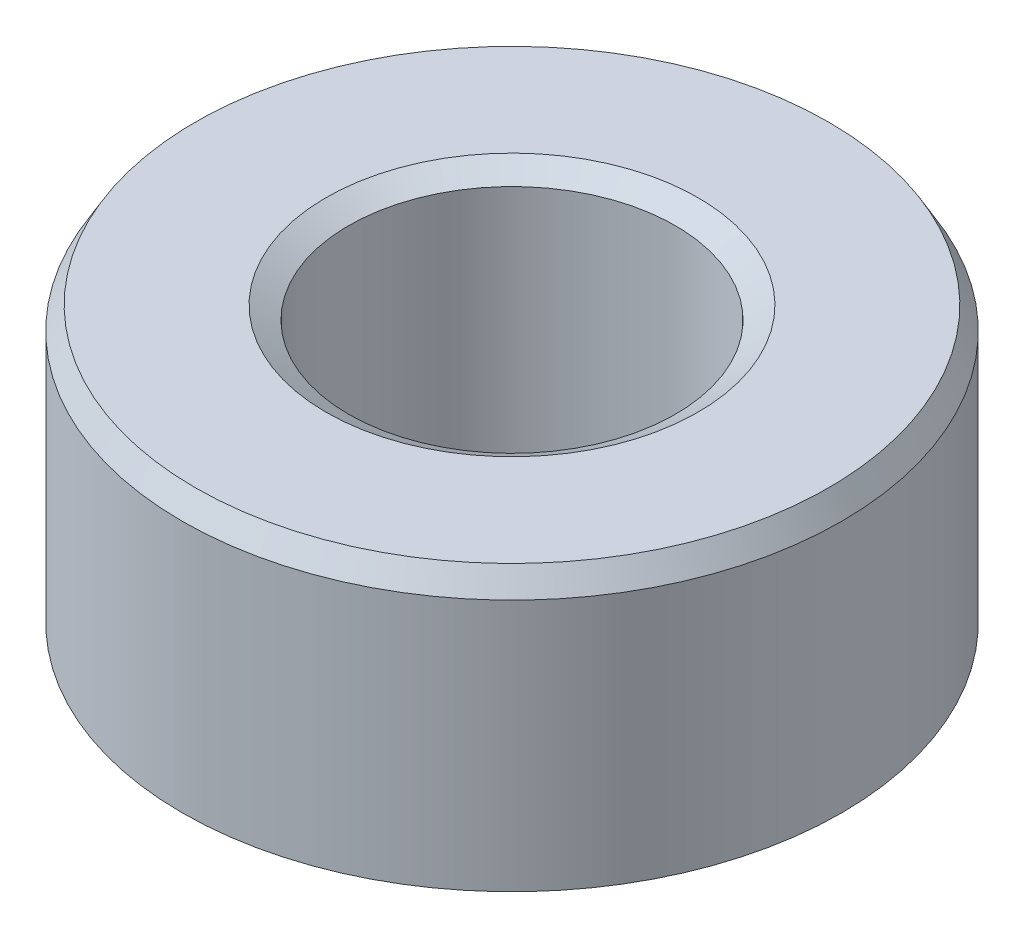
ISO-10303-21;
HEADER;
FILE_DESCRIPTION(('STEP AP214'),'2;1');
FILE_NAME('part.step','',(''),(''),'','','');
FILE_SCHEMA(('AUTOMOTIVE_DESIGN { 1 0 10303 214 1 1 1 1 }'));
ENDSEC;
DATA;
#1=APPLICATION_CONTEXT('core data for automotive mechanical design processes');
#2=APPLICATION_PROTOCOL_DEFINITION('international standard','automotive_design',2000,#1);
#3=PRODUCT_CONTEXT('',#1,'mechanical');
#4=PRODUCT('Part','Part','',(#3));
#5=PRODUCT_RELATED_PRODUCT_CATEGORY('part','',(#4));
#6=PRODUCT_DEFINITION_FORMATION('','',#4);
#7=PRODUCT_DEFINITION_CONTEXT('part definition',#1,'design');
#8=PRODUCT_DEFINITION('design','',#6,#7);
#9=PRODUCT_DEFINITION_SHAPE('','',#8);
#10=(LENGTH_UNIT() NAMED_UNIT(*) SI_UNIT(.MILLI.,.METRE.));
#11=(NAMED_UNIT(*) PLANE_ANGLE_UNIT() SI_UNIT($,.RADIAN.));
#12=(NAMED_UNIT(*) SI_UNIT($,.STERADIAN.) SOLID_ANGLE_UNIT());
#13=UNCERTAINTY_MEASURE_WITH_UNIT(LENGTH_MEASURE(1.E-05),#10,'distance_accuracy_value','');
#14=(GEOMETRIC_REPRESENTATION_CONTEXT(3) GLOBAL_UNCERTAINTY_ASSIGNED_CONTEXT((#13)) GLOBAL_UNIT_ASSIGNED_CONTEXT((#10,
#11,#12)) REPRESENTATION_CONTEXT('',''));
#15=CARTESIAN_POINT('',(0.,0.,0.));
#16=DIRECTION('',(0.,0.,1.));
#17=DIRECTION('',(1.,0.,0.));
#18=AXIS2_PLACEMENT_3D('',#15,#16,#17);
#19=CARTESIAN_POINT('',(0.,48.0601780285572,0.));
#20=DIRECTION('',(0.,-1.,0.));
#21=DIRECTION('',(0.,0.,-1.));
#22=AXIS2_PLACEMENT_3D('',#19,#20,#21);
#23=CYLINDRICAL_SURFACE('',#22,55.);
#24=CARTESIAN_POINT('',(0.,2.17141294679618,0.));
#25=DIRECTION('',(0.,1.,0.));
#26=DIRECTION('',(0.,0.,1.));
#27=AXIS2_PLACEMENT_3D('',#24,#25,#26);
#28=CIRCLE('',#27,55.);
#29=CARTESIAN_POINT('',(0.,2.17141294679618,55.));
#30=VERTEX_POINT('',#29);
#31=EDGE_CURVE('E10',#30,#30,#28,.T.);
#32=ORIENTED_EDGE('',*,*,#31,.T.);
#33=EDGE_LOOP('',(#32));
#34=FACE_BOUND('',#33,.T.);
#35=CARTESIAN_POINT('',(0.,44.2991804804934,0.));
#36=DIRECTION('',(0.,1.,0.));
#37=DIRECTION('',(0.,0.,1.));
#38=AXIS2_PLACEMENT_3D('',#35,#36,#37);
#39=CIRCLE('',#38,55.);
#40=CARTESIAN_POINT('',(0.,44.2991804804934,-55.));
#41=VERTEX_POINT('',#40);
#42=EDGE_CURVE('E50',#41,#41,#39,.F.);
#43=ORIENTED_EDGE('',*,*,#42,.T.);
#44=EDGE_LOOP('',(#43));
#45=FACE_BOUND('',#44,.T.);
#46=ADVANCED_FACE('F39',(#34,#45),#23,.T.);
#47=CARTESIAN_POINT('',(0.,48.0601780285572,0.));
#48=DIRECTION('',(0.,1.,0.));
#49=DIRECTION('',(0.,0.,1.));
#50=AXIS2_PLACEMENT_3D('',#47,#48,#49);
#51=PLANE('',#50);
#52=CARTESIAN_POINT('',(0.,48.0601780285572,0.));
#53=DIRECTION('',(0.,1.,0.));
#54=DIRECTION('',(0.,0.,1.));
#55=AXIS2_PLACEMENT_3D('',#52,#53,#54);
#56=CIRCLE('',#55,31.0200479257337);
#57=CARTESIAN_POINT('',(0.,48.0601780285572,31.0200479257337));
#58=VERTEX_POINT('',#57);
#59=EDGE_CURVE('E58',#58,#58,#56,.F.);
#60=ORIENTED_EDGE('',*,*,#59,.T.);
#61=EDGE_LOOP('',(#60));
#62=FACE_BOUND('',#61,.T.);
#63=CARTESIAN_POINT('',(0.,48.0601780285572,0.));
#64=DIRECTION('',(0.,1.,0.));
#65=DIRECTION('',(0.,0.,1.));
#66=AXIS2_PLACEMENT_3D('',#63,#64,#65);
#67=CIRCLE('',#66,52.8285870532038);
#68=CARTESIAN_POINT('',(0.,48.0601780285572,-52.8285870532038));
#69=VERTEX_POINT('',#68);
#70=EDGE_CURVE('E61',#69,#69,#67,.T.);
#71=ORIENTED_EDGE('',*,*,#70,.T.);
#72=EDGE_LOOP('',(#71));
#73=FACE_BOUND('',#72,.T.);
#74=ADVANCED_FACE('F88',(#62,#73),#51,.T.);
#75=CARTESIAN_POINT('',(0.,0.,0.));
#76=DIRECTION('',(0.,1.,0.));
#77=DIRECTION('',(0.,0.,1.));
#78=AXIS2_PLACEMENT_3D('',#75,#76,#77);
#79=PLANE('',#78);
#80=CARTESIAN_POINT('',(0.,0.,0.));
#81=DIRECTION('',(0.,1.,0.));
#82=DIRECTION('',(0.,0.,1.));
#83=AXIS2_PLACEMENT_3D('',#80,#81,#82);
#84=CIRCLE('',#83,29.430463324466);
#85=CARTESIAN_POINT('',(0.,0.,29.430463324466));
#86=VERTEX_POINT('',#85);
#87=EDGE_CURVE('E51',#86,#86,#84,.T.);
#88=ORIENTED_EDGE('',*,*,#87,.T.);
#89=EDGE_LOOP('',(#88));
#90=FACE_BOUND('',#89,.T.);
#91=CARTESIAN_POINT('',(0.,0.,0.));
#92=DIRECTION('',(0.,1.,0.));
#93=DIRECTION('',(0.,0.,1.));
#94=AXIS2_PLACEMENT_3D('',#91,#92,#93);
#95=CIRCLE('',#94,51.2390024519361);
#96=CARTESIAN_POINT('',(0.,0.,51.2390024519361));
#97=VERTEX_POINT('',#96);
#98=EDGE_CURVE('E54',#97,#97,#95,.F.);
#99=ORIENTED_EDGE('',*,*,#98,.T.);
#100=EDGE_LOOP('',(#99));
#101=FACE_BOUND('',#100,.T.);
#102=ADVANCED_FACE('F83',(#90,#101),#79,.F.);
#103=CARTESIAN_POINT('',(0.,48.0601780285572,0.));
#104=DIRECTION('',(0.,-1.,0.));
#105=DIRECTION('',(0.,0.,-1.));
#106=AXIS2_PLACEMENT_3D('',#103,#104,#105);
#107=CYLINDRICAL_SURFACE('',#106,27.2590503776699);
#108=CARTESIAN_POINT('',(0.,45.888765081761,0.));
#109=DIRECTION('',(0.,1.,0.));
#110=DIRECTION('',(0.,0.,1.));
#111=AXIS2_PLACEMENT_3D('',#108,#109,#110);
#112=CIRCLE('',#111,27.2590503776699);
#113=CARTESIAN_POINT('',(0.,45.888765081761,27.2590503776699));
#114=VERTEX_POINT('',#113);
#115=EDGE_CURVE('E67',#114,#114,#112,.T.);
#116=ORIENTED_EDGE('',*,*,#115,.T.);
#117=EDGE_LOOP('',(#116));
#118=FACE_BOUND('',#117,.T.);
#119=CARTESIAN_POINT('',(0.,3.7609975480638,0.));
#120=DIRECTION('',(0.,1.,0.));
#121=DIRECTION('',(0.,0.,1.));
#122=AXIS2_PLACEMENT_3D('',#119,#120,#121);
#123=CIRCLE('',#122,27.2590503776699);
#124=CARTESIAN_POINT('',(0.,3.7609975480638,27.2590503776699));
#125=VERTEX_POINT('',#124);
#126=EDGE_CURVE('E69',#125,#125,#123,.F.);
#127=ORIENTED_EDGE('',*,*,#126,.T.);
#128=EDGE_LOOP('',(#127));
#129=FACE_BOUND('',#128,.T.);
#130=ADVANCED_FACE('F71',(#118,#129),#107,.F.);
#131=CARTESIAN_POINT('',(0.,45.888765081761,0.));
#132=DIRECTION('',(0.,1.,0.));
#133=DIRECTION('',(0.,0.,1.));
#134=AXIS2_PLACEMENT_3D('',#131,#132,#133);
#135=CONICAL_SURFACE('',#134,27.2590503776699,1.0471975511966);
#136=ORIENTED_EDGE('',*,*,#59,.F.);
#137=EDGE_LOOP('',(#136));
#138=FACE_BOUND('',#137,.T.);
#139=ORIENTED_EDGE('',*,*,#115,.F.);
#140=EDGE_LOOP('',(#139));
#141=FACE_BOUND('',#140,.T.);
#142=ADVANCED_FACE('F77',(#138,#141),#135,.F.);
#143=CARTESIAN_POINT('',(0.,0.,0.));
#144=DIRECTION('',(0.,-1.,0.));
#145=DIRECTION('',(0.,0.,-1.));
#146=AXIS2_PLACEMENT_3D('',#143,#144,#145);
#147=CONICAL_SURFACE('',#146,29.430463324466,0.523598775598297);
#148=ORIENTED_EDGE('',*,*,#126,.F.);
#149=EDGE_LOOP('',(#148));
#150=FACE_BOUND('',#149,.T.);
#151=ORIENTED_EDGE('',*,*,#87,.F.);
#152=EDGE_LOOP('',(#151));
#153=FACE_BOUND('',#152,.T.);
#154=ADVANCED_FACE('F73',(#150,#153),#147,.F.);
#155=CARTESIAN_POINT('',(0.,2.17141294679618,0.));
#156=DIRECTION('',(0.,1.,0.));
#157=DIRECTION('',(0.,0.,1.));
#158=AXIS2_PLACEMENT_3D('',#155,#156,#157);
#159=CONICAL_SURFACE('',#158,55.,1.0471975511966);
#160=ORIENTED_EDGE('',*,*,#98,.F.);
#161=EDGE_LOOP('',(#160));
#162=FACE_BOUND('',#161,.T.);
#163=ORIENTED_EDGE('',*,*,#31,.F.);
#164=EDGE_LOOP('',(#163));
#165=FACE_BOUND('',#164,.T.);
#166=ADVANCED_FACE('F76',(#162,#165),#159,.T.);
#167=CARTESIAN_POINT('',(0.,48.0601780285572,0.));
#168=DIRECTION('',(0.,-1.,0.));
#169=DIRECTION('',(0.,0.,-1.));
#170=AXIS2_PLACEMENT_3D('',#167,#168,#169);
#171=CONICAL_SURFACE('',#170,52.8285870532038,0.523598775598298);
#172=CARTESIAN_POINT('',(0.,44.2991804804934,-55.));
#173=CARTESIAN_POINT('',(0.,44.3383575382857,-54.9773811151375));
#174=CARTESIAN_POINT('',(0.,44.377534596078,-54.9547622302751));
#175=CARTESIAN_POINT('',(0.,44.4558887116627,-54.9095244605502));
#176=CARTESIAN_POINT('',(0.,44.495065769455,-54.8869055756877));
#177=CARTESIAN_POINT('',(0.,44.5734198850397,-54.8416678059628));
#178=CARTESIAN_POINT('',(0.,44.612596942832,-54.8190489211003));
#179=CARTESIAN_POINT('',(0.,44.6909510584167,-54.7738111513754));
#180=CARTESIAN_POINT('',(0.,44.730128116209,-54.7511922665129));
#181=CARTESIAN_POINT('',(0.,44.8084822317937,-54.705954496788));
#182=CARTESIAN_POINT('',(0.,44.847659289586,-54.6833356119256));
#183=CARTESIAN_POINT('',(0.,44.9260134051707,-54.6380978422006));
#184=CARTESIAN_POINT('',(0.,44.965190462963,-54.6154789573382));
#185=CARTESIAN_POINT('',(0.,45.0435445785477,-54.5702411876133));
#186=CARTESIAN_POINT('',(0.,45.08272163634,-54.5476223027508));
#187=CARTESIAN_POINT('',(0.,45.1610757519247,-54.5023845330259));
#188=CARTESIAN_POINT('',(0.,45.200252809717,-54.4797656481634));
#189=CARTESIAN_POINT('',(0.,45.2786069253017,-54.4345278784385));
#190=CARTESIAN_POINT('',(0.,45.317783983094,-54.411908993576));
#191=CARTESIAN_POINT('',(0.,45.3961380986786,-54.3666712238511));
#192=CARTESIAN_POINT('',(0.,45.435315156471,-54.3440523389887));
#193=CARTESIAN_POINT('',(0.,45.5136692720556,-54.2988145692637));
#194=CARTESIAN_POINT('',(0.,45.552846329848,-54.2761956844013));
#195=CARTESIAN_POINT('',(0.,45.6312004454326,-54.2309579146764));
#196=CARTESIAN_POINT('',(0.,45.670377503225,-54.2083390298139));
#197=CARTESIAN_POINT('',(0.,45.7487316188096,-54.163101260089));
#198=CARTESIAN_POINT('',(0.,45.787908676602,-54.1404823752265));
#199=CARTESIAN_POINT('',(0.,45.8662627921866,-54.0952446055016));
#200=CARTESIAN_POINT('',(0.,45.905439849979,-54.0726257206391));
#201=CARTESIAN_POINT('',(0.,45.9837939655636,-54.0273879509142));
#202=CARTESIAN_POINT('',(0.,46.022971023356,-54.0047690660518));
#203=CARTESIAN_POINT('',(0.,46.1013251389406,-53.9595312963268));
#204=CARTESIAN_POINT('',(0.,46.1405021967329,-53.9369124114644));
#205=CARTESIAN_POINT('',(0.,46.2188563123176,-53.8916746417395));
#206=CARTESIAN_POINT('',(0.,46.2580333701099,-53.869055756877));
#207=CARTESIAN_POINT('',(0.,46.3363874856946,-53.8238179871521));
#208=CARTESIAN_POINT('',(0.,46.3755645434869,-53.8011991022896));
#209=CARTESIAN_POINT('',(0.,46.4539186590716,-53.7559613325647));
#210=CARTESIAN_POINT('',(0.,46.4930957168639,-53.7333424477022));
#211=CARTESIAN_POINT('',(0.,46.5714498324486,-53.6881046779773));
#212=CARTESIAN_POINT('',(0.,46.6106268902409,-53.6654857931149));
#213=CARTESIAN_POINT('',(0.,46.6889810058256,-53.6202480233899));
#214=CARTESIAN_POINT('',(0.,46.7281580636179,-53.5976291385275));
#215=CARTESIAN_POINT('',(0.,46.8065121792026,-53.5523913688025));
#216=CARTESIAN_POINT('',(0.,46.8456892369949,-53.5297724839401));
#217=CARTESIAN_POINT('',(0.,46.9240433525796,-53.4845347142152));
#218=CARTESIAN_POINT('',(0.,46.9632204103719,-53.4619158293527));
#219=CARTESIAN_POINT('',(0.,47.0415745259566,-53.4166780596278));
#220=CARTESIAN_POINT('',(0.,47.0807515837489,-53.3940591747653));
#221=CARTESIAN_POINT('',(0.,47.1591056993336,-53.3488214050404));
#222=CARTESIAN_POINT('',(0.,47.1982827571259,-53.3262025201779));
#223=CARTESIAN_POINT('',(0.,47.2766368727106,-53.280964750453));
#224=CARTESIAN_POINT('',(0.,47.3158139305029,-53.2583458655906));
#225=CARTESIAN_POINT('',(0.,47.3941680460876,-53.2131080958657));
#226=CARTESIAN_POINT('',(0.,47.4333451038799,-53.1904892110032));
#227=CARTESIAN_POINT('',(0.,47.5116992194646,-53.1452514412783));
#228=CARTESIAN_POINT('',(0.,47.5508762772569,-53.1226325564158));
#229=CARTESIAN_POINT('',(0.,47.6292303928415,-53.0773947866909));
#230=CARTESIAN_POINT('',(0.,47.6684074506339,-53.0547759018284));
#231=CARTESIAN_POINT('',(0.,47.7467615662185,-53.0095381321035));
#232=CARTESIAN_POINT('',(0.,47.7859386240109,-52.986919247241));
#233=CARTESIAN_POINT('',(0.,47.8642927395955,-52.9416814775161));
#234=CARTESIAN_POINT('',(0.,47.9034697973879,-52.9190625926537));
#235=CARTESIAN_POINT('',(0.,47.9818239129725,-52.8738248229287));
#236=CARTESIAN_POINT('',(0.,48.0210009707649,-52.8512059380663));
#237=CARTESIAN_POINT('',(0.,48.0601780285572,-52.8285870532038));
#238=B_SPLINE_CURVE_WITH_KNOTS('',3,(#172,#173,#174,#175,#176,#177,#178,#179,#180,#181,#182,
#183,#184,#185,#186,#187,#188,#189,#190,#191,#192,#193,#194,#195,#196,#197,#198,#199,#200,#201,
#202,#203,#204,#205,#206,#207,#208,#209,#210,#211,#212,#213,#214,#215,#216,#217,#218,#219,#220,
#221,#222,#223,#224,#225,#226,#227,#228,#229,#230,#231,#232,#233,#234,#235,#236,#237),
.UNSPECIFIED.,.F.,.F.,(4,2,2,2,2,2,2,2,2,2,2,2,2,2,2,2,2,2,2,2,2,2,2,2,2,2,2,2,2,2,2,2,4),(0.,
0.135713309174755,0.271426618349519,0.407139927524277,0.542853236699041,0.678566545873802,
0.81427985504856,0.949993164223324,1.08570647339809,1.22141978257284,1.35713309174761,
1.49284640092237,1.62855971009713,1.76427301927189,1.89998632844665,2.03569963762141,
2.17141294679617,2.30712625597093,2.4428395651457,2.57855287432045,2.71426618349522,
2.84997949266998,2.98569280184474,3.1214061110195,3.25711942019426,3.39283272936902,
3.52854603854378,3.66425934771854,3.7999726568933,3.93568596606807,4.07139927524282,
4.20711258441759,4.34282589359235),.UNSPECIFIED.);
#239=EDGE_CURVE('BSEAM45',#41,#69,#238,.T.);
#240=ORIENTED_EDGE('',*,*,#42,.F.);
#241=ORIENTED_EDGE('',*,*,#70,.F.);
#242=ORIENTED_EDGE('',*,*,#239,.T.);
#243=ORIENTED_EDGE('',*,*,#239,.F.);
#244=EDGE_LOOP('',(#240,#242,#241,#243));
#245=FACE_BOUND('',#244,.T.);
#246=ADVANCED_FACE('F45',(#245),#171,.T.);
#247=CLOSED_SHELL('',(#46,#74,#102,#130,#142,#154,#166,#246));
#248=MANIFOLD_SOLID_BREP('B2',#247);
#249=ADVANCED_BREP_SHAPE_REPRESENTATION('',(#18,#248),#14);
#250=SHAPE_DEFINITION_REPRESENTATION(#9,#249);
ENDSEC;
END-ISO-10303-21;
